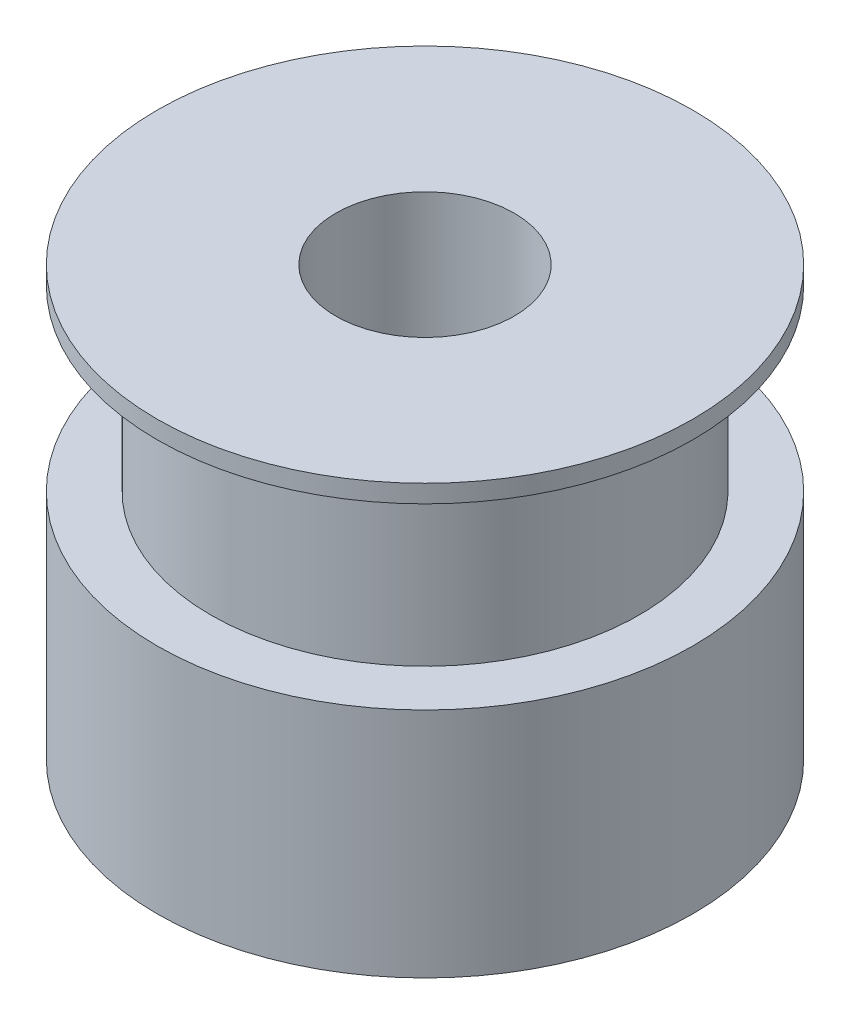
ISO-10303-21;
HEADER;
FILE_DESCRIPTION(('STEP AP214'),'2;1');
FILE_NAME('part.step','',(''),(''),'','','');
FILE_SCHEMA(('AUTOMOTIVE_DESIGN { 1 0 10303 214 1 1 1 1 }'));
ENDSEC;
DATA;
#1=APPLICATION_CONTEXT('core data for automotive mechanical design processes');
#2=APPLICATION_PROTOCOL_DEFINITION('international standard','automotive_design',2000,#1);
#3=PRODUCT_CONTEXT('',#1,'mechanical');
#4=PRODUCT('Part','Part','',(#3));
#5=PRODUCT_RELATED_PRODUCT_CATEGORY('part','',(#4));
#6=PRODUCT_DEFINITION_FORMATION('','',#4);
#7=PRODUCT_DEFINITION_CONTEXT('part definition',#1,'design');
#8=PRODUCT_DEFINITION('design','',#6,#7);
#9=PRODUCT_DEFINITION_SHAPE('','',#8);
#10=(LENGTH_UNIT() NAMED_UNIT(*) SI_UNIT(.MILLI.,.METRE.));
#11=(NAMED_UNIT(*) PLANE_ANGLE_UNIT() SI_UNIT($,.RADIAN.));
#12=(NAMED_UNIT(*) SI_UNIT($,.STERADIAN.) SOLID_ANGLE_UNIT());
#13=UNCERTAINTY_MEASURE_WITH_UNIT(LENGTH_MEASURE(1.E-05),#10,'distance_accuracy_value','');
#14=(GEOMETRIC_REPRESENTATION_CONTEXT(3) GLOBAL_UNCERTAINTY_ASSIGNED_CONTEXT((#13)) GLOBAL_UNIT_ASSIGNED_CONTEXT((#10,
#11,#12)) REPRESENTATION_CONTEXT('',''));
#15=CARTESIAN_POINT('',(0.,0.,0.));
#16=DIRECTION('',(0.,0.,1.));
#17=DIRECTION('',(1.,0.,0.));
#18=AXIS2_PLACEMENT_3D('',#15,#16,#17);
#19=CARTESIAN_POINT('',(-7.5,-12.,0.));
#20=DIRECTION('',(0.,1.,0.));
#21=DIRECTION('',(0.,0.,1.));
#22=AXIS2_PLACEMENT_3D('',#19,#20,#21);
#23=PLANE('',#22);
#24=CARTESIAN_POINT('',(0.,-12.,0.));
#25=DIRECTION('',(0.,-1.,0.));
#26=DIRECTION('',(0.,0.,-1.));
#27=AXIS2_PLACEMENT_3D('',#24,#25,#26);
#28=CIRCLE('',#27,2.5);
#29=CARTESIAN_POINT('',(0.,-12.,-2.5));
#30=VERTEX_POINT('',#29);
#31=EDGE_CURVE('E10',#30,#30,#28,.T.);
#32=ORIENTED_EDGE('',*,*,#31,.F.);
#33=EDGE_LOOP('',(#32));
#34=FACE_BOUND('',#33,.T.);
#35=CARTESIAN_POINT('',(0.,-12.,0.));
#36=DIRECTION('',(0.,-1.,0.));
#37=DIRECTION('',(0.,0.,-1.));
#38=AXIS2_PLACEMENT_3D('',#35,#36,#37);
#39=CIRCLE('',#38,7.5);
#40=CARTESIAN_POINT('',(0.,-12.,-7.5));
#41=VERTEX_POINT('',#40);
#42=EDGE_CURVE('E68',#41,#41,#39,.T.);
#43=ORIENTED_EDGE('',*,*,#42,.T.);
#44=EDGE_LOOP('',(#43));
#45=FACE_BOUND('',#44,.T.);
#46=ADVANCED_FACE('F32',(#34,#45),#23,.F.);
#47=CARTESIAN_POINT('',(0.,-5.59651029907093,0.));
#48=DIRECTION('',(0.,-1.,0.));
#49=DIRECTION('',(0.,0.,-1.));
#50=AXIS2_PLACEMENT_3D('',#47,#48,#49);
#51=CYLINDRICAL_SURFACE('',#50,2.5);
#52=CARTESIAN_POINT('',(0.,0.,0.));
#53=DIRECTION('',(0.,-1.,0.));
#54=DIRECTION('',(0.,0.,-1.));
#55=AXIS2_PLACEMENT_3D('',#52,#53,#54);
#56=CIRCLE('',#55,2.5);
#57=CARTESIAN_POINT('',(0.,0.,-2.5));
#58=VERTEX_POINT('',#57);
#59=EDGE_CURVE('E39',#58,#58,#56,.T.);
#60=ORIENTED_EDGE('',*,*,#59,.F.);
#61=EDGE_LOOP('',(#60));
#62=FACE_BOUND('',#61,.T.);
#63=ORIENTED_EDGE('',*,*,#31,.T.);
#64=EDGE_LOOP('',(#63));
#65=FACE_BOUND('',#64,.T.);
#66=ADVANCED_FACE('F105',(#62,#65),#51,.F.);
#67=CARTESIAN_POINT('',(-2.5,0.,0.));
#68=DIRECTION('',(0.,-1.,0.));
#69=DIRECTION('',(0.,0.,-1.));
#70=AXIS2_PLACEMENT_3D('',#67,#68,#69);
#71=PLANE('',#70);
#72=CARTESIAN_POINT('',(0.,0.,0.));
#73=DIRECTION('',(0.,-1.,0.));
#74=DIRECTION('',(0.,0.,-1.));
#75=AXIS2_PLACEMENT_3D('',#72,#73,#74);
#76=CIRCLE('',#75,7.5);
#77=CARTESIAN_POINT('',(0.,0.,-7.5));
#78=VERTEX_POINT('',#77);
#79=EDGE_CURVE('E46',#78,#78,#76,.T.);
#80=ORIENTED_EDGE('',*,*,#79,.F.);
#81=EDGE_LOOP('',(#80));
#82=FACE_BOUND('',#81,.T.);
#83=ORIENTED_EDGE('',*,*,#59,.T.);
#84=EDGE_LOOP('',(#83));
#85=FACE_BOUND('',#84,.T.);
#86=ADVANCED_FACE('F100',(#82,#85),#71,.F.);
#87=CARTESIAN_POINT('',(0.,-5.59651029907093,0.));
#88=DIRECTION('',(0.,-1.,0.));
#89=DIRECTION('',(0.,0.,-1.));
#90=AXIS2_PLACEMENT_3D('',#87,#88,#89);
#91=CYLINDRICAL_SURFACE('',#90,7.5);
#92=CARTESIAN_POINT('',(0.,-0.5,0.));
#93=DIRECTION('',(0.,-1.,0.));
#94=DIRECTION('',(0.,0.,-1.));
#95=AXIS2_PLACEMENT_3D('',#92,#93,#94);
#96=CIRCLE('',#95,7.5);
#97=CARTESIAN_POINT('',(0.,-0.5,-7.5));
#98=VERTEX_POINT('',#97);
#99=EDGE_CURVE('E51',#98,#98,#96,.T.);
#100=ORIENTED_EDGE('',*,*,#99,.F.);
#101=EDGE_LOOP('',(#100));
#102=FACE_BOUND('',#101,.T.);
#103=ORIENTED_EDGE('',*,*,#79,.T.);
#104=EDGE_LOOP('',(#103));
#105=FACE_BOUND('',#104,.T.);
#106=ADVANCED_FACE('F94',(#102,#105),#91,.T.);
#107=CARTESIAN_POINT('',(-7.5,-0.500000000000001,0.));
#108=DIRECTION('',(0.,1.,0.));
#109=DIRECTION('',(0.,0.,1.));
#110=AXIS2_PLACEMENT_3D('',#107,#108,#109);
#111=PLANE('',#110);
#112=CARTESIAN_POINT('',(0.,-0.5,0.));
#113=DIRECTION('',(0.,-1.,0.));
#114=DIRECTION('',(0.,0.,-1.));
#115=AXIS2_PLACEMENT_3D('',#112,#113,#114);
#116=CIRCLE('',#115,6.);
#117=CARTESIAN_POINT('',(0.,-0.5,-6.));
#118=VERTEX_POINT('',#117);
#119=EDGE_CURVE('E57',#118,#118,#116,.T.);
#120=ORIENTED_EDGE('',*,*,#119,.F.);
#121=EDGE_LOOP('',(#120));
#122=FACE_BOUND('',#121,.T.);
#123=ORIENTED_EDGE('',*,*,#99,.T.);
#124=EDGE_LOOP('',(#123));
#125=FACE_BOUND('',#124,.T.);
#126=ADVANCED_FACE('F88',(#122,#125),#111,.F.);
#127=CARTESIAN_POINT('',(0.,-5.59651029907093,0.));
#128=DIRECTION('',(0.,-1.,0.));
#129=DIRECTION('',(0.,0.,-1.));
#130=AXIS2_PLACEMENT_3D('',#127,#128,#129);
#131=CYLINDRICAL_SURFACE('',#130,6.);
#132=CARTESIAN_POINT('',(0.,-5.5,0.));
#133=DIRECTION('',(0.,-1.,0.));
#134=DIRECTION('',(0.,0.,-1.));
#135=AXIS2_PLACEMENT_3D('',#132,#133,#134);
#136=CIRCLE('',#135,6.);
#137=CARTESIAN_POINT('',(0.,-5.5,-6.));
#138=VERTEX_POINT('',#137);
#139=EDGE_CURVE('E61',#138,#138,#136,.T.);
#140=ORIENTED_EDGE('',*,*,#139,.F.);
#141=EDGE_LOOP('',(#140));
#142=FACE_BOUND('',#141,.T.);
#143=ORIENTED_EDGE('',*,*,#119,.T.);
#144=EDGE_LOOP('',(#143));
#145=FACE_BOUND('',#144,.T.);
#146=ADVANCED_FACE('F82',(#142,#145),#131,.T.);
#147=CARTESIAN_POINT('',(-6.,-5.5,0.));
#148=DIRECTION('',(0.,-1.,0.));
#149=DIRECTION('',(0.,0.,-1.));
#150=AXIS2_PLACEMENT_3D('',#147,#148,#149);
#151=PLANE('',#150);
#152=CARTESIAN_POINT('',(0.,-5.5,0.));
#153=DIRECTION('',(0.,-1.,0.));
#154=DIRECTION('',(0.,0.,-1.));
#155=AXIS2_PLACEMENT_3D('',#152,#153,#154);
#156=CIRCLE('',#155,7.5);
#157=CARTESIAN_POINT('',(0.,-5.5,-7.5));
#158=VERTEX_POINT('',#157);
#159=EDGE_CURVE('E64',#158,#158,#156,.T.);
#160=ORIENTED_EDGE('',*,*,#159,.F.);
#161=EDGE_LOOP('',(#160));
#162=FACE_BOUND('',#161,.T.);
#163=ORIENTED_EDGE('',*,*,#139,.T.);
#164=EDGE_LOOP('',(#163));
#165=FACE_BOUND('',#164,.T.);
#166=ADVANCED_FACE('F76',(#162,#165),#151,.F.);
#167=CARTESIAN_POINT('',(0.,-5.59651029907093,0.));
#168=DIRECTION('',(0.,-1.,0.));
#169=DIRECTION('',(0.,0.,-1.));
#170=AXIS2_PLACEMENT_3D('',#167,#168,#169);
#171=CYLINDRICAL_SURFACE('',#170,7.5);
#172=ORIENTED_EDGE('',*,*,#42,.F.);
#173=EDGE_LOOP('',(#172));
#174=FACE_BOUND('',#173,.T.);
#175=ORIENTED_EDGE('',*,*,#159,.T.);
#176=EDGE_LOOP('',(#175));
#177=FACE_BOUND('',#176,.T.);
#178=ADVANCED_FACE('F73',(#174,#177),#171,.T.);
#179=CLOSED_SHELL('',(#46,#66,#86,#106,#126,#146,#166,#178));
#180=MANIFOLD_SOLID_BREP('B2',#179);
#181=ADVANCED_BREP_SHAPE_REPRESENTATION('',(#18,#180),#14);
#182=SHAPE_DEFINITION_REPRESENTATION(#9,#181);
ENDSEC;
END-ISO-10303-21;
